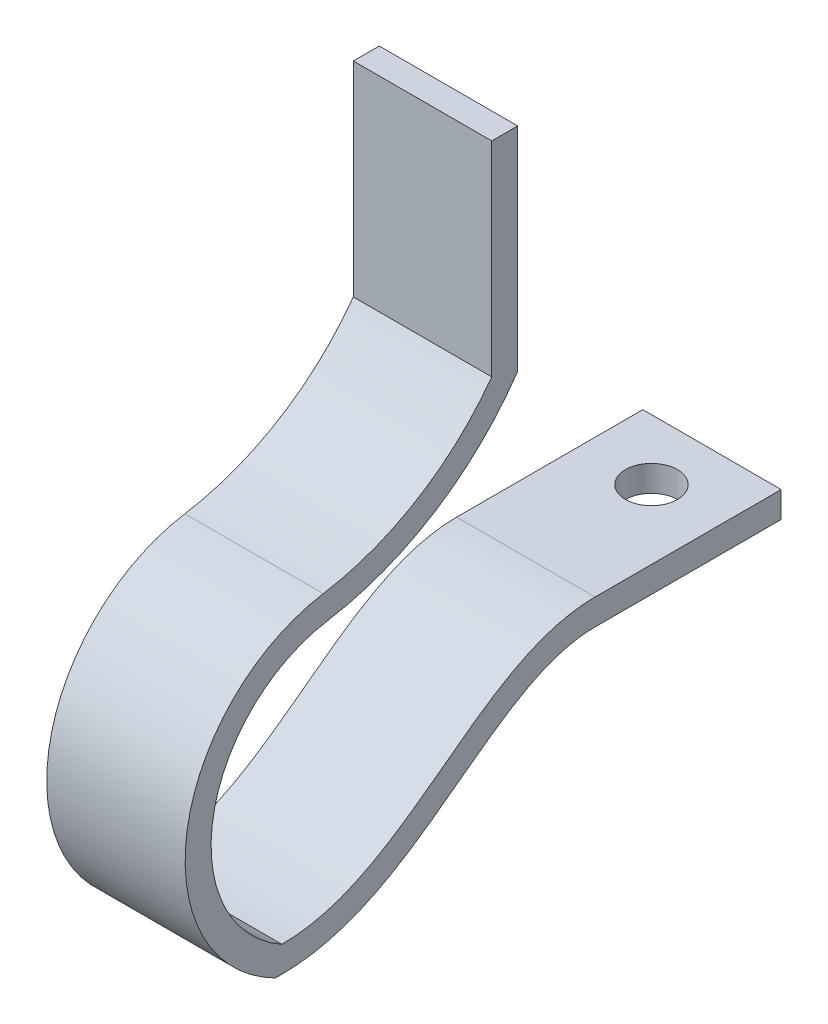
ISO-10303-21;
HEADER;
FILE_DESCRIPTION(('STEP AP214'),'2;1');
FILE_NAME('part.step','',(''),(''),'','','');
FILE_SCHEMA(('AUTOMOTIVE_DESIGN { 1 0 10303 214 1 1 1 1 }'));
ENDSEC;
DATA;
#1=APPLICATION_CONTEXT('core data for automotive mechanical design processes');
#2=APPLICATION_PROTOCOL_DEFINITION('international standard','automotive_design',2000,#1);
#3=PRODUCT_CONTEXT('',#1,'mechanical');
#4=PRODUCT('Part','Part','',(#3));
#5=PRODUCT_RELATED_PRODUCT_CATEGORY('part','',(#4));
#6=PRODUCT_DEFINITION_FORMATION('','',#4);
#7=PRODUCT_DEFINITION_CONTEXT('part definition',#1,'design');
#8=PRODUCT_DEFINITION('design','',#6,#7);
#9=PRODUCT_DEFINITION_SHAPE('','',#8);
#10=(LENGTH_UNIT() NAMED_UNIT(*) SI_UNIT(.MILLI.,.METRE.));
#11=(NAMED_UNIT(*) PLANE_ANGLE_UNIT() SI_UNIT($,.RADIAN.));
#12=(NAMED_UNIT(*) SI_UNIT($,.STERADIAN.) SOLID_ANGLE_UNIT());
#13=UNCERTAINTY_MEASURE_WITH_UNIT(LENGTH_MEASURE(1.E-05),#10,'distance_accuracy_value','');
#14=(GEOMETRIC_REPRESENTATION_CONTEXT(3) GLOBAL_UNCERTAINTY_ASSIGNED_CONTEXT((#13)) GLOBAL_UNIT_ASSIGNED_CONTEXT((#10,
#11,#12)) REPRESENTATION_CONTEXT('',''));
#15=CARTESIAN_POINT('',(0.,0.,0.));
#16=DIRECTION('',(0.,0.,1.));
#17=DIRECTION('',(1.,0.,0.));
#18=AXIS2_PLACEMENT_3D('',#15,#16,#17);
#19=CARTESIAN_POINT('',(-4.064,-12.5578263315465,0.));
#20=DIRECTION('',(0.,1.,0.));
#21=DIRECTION('',(0.,0.,1.));
#22=AXIS2_PLACEMENT_3D('',#19,#20,#21);
#23=PLANE('',#22);
#24=DIRECTION('',(0.,0.,1.));
#25=VECTOR('',#24,1.);
#26=CARTESIAN_POINT('',(0.,-12.5578263315465,0.));
#27=LINE('',#26,#25);
#28=CARTESIAN_POINT('',(0.,-12.5578263315465,1.43547216691102));
#29=VERTEX_POINT('',#28);
#30=CARTESIAN_POINT('',(0.,-12.5578263315465,1.62504224617955));
#31=VERTEX_POINT('',#30);
#32=EDGE_CURVE('E201',#29,#31,#27,.T.);
#33=ORIENTED_EDGE('',*,*,#32,.T.);
#34=DIRECTION('',(1.,0.,0.));
#35=VECTOR('',#34,1.);
#36=CARTESIAN_POINT('',(-4.064,-12.5578263315465,1.62504224617955));
#37=LINE('',#36,#35);
#38=CARTESIAN_POINT('',(-4.064,-12.5578263315465,1.62504224617955));
#39=VERTEX_POINT('',#38);
#40=EDGE_CURVE('E11',#39,#31,#37,.T.);
#41=ORIENTED_EDGE('',*,*,#40,.F.);
#42=DIRECTION('',(0.,0.,1.));
#43=VECTOR('',#42,1.);
#44=CARTESIAN_POINT('',(-4.064,-12.5578263315465,0.));
#45=LINE('',#44,#43);
#46=CARTESIAN_POINT('',(-4.064,-12.5578263315465,1.43547216691102));
#47=VERTEX_POINT('',#46);
#48=EDGE_CURVE('E254',#47,#39,#45,.T.);
#49=ORIENTED_EDGE('',*,*,#48,.F.);
#50=DIRECTION('',(1.,0.,0.));
#51=VECTOR('',#50,1.);
#52=CARTESIAN_POINT('',(-4.064,-12.5578263315465,1.43547216691102));
#53=LINE('',#52,#51);
#54=EDGE_CURVE('E130',#47,#29,#53,.T.);
#55=ORIENTED_EDGE('',*,*,#54,.T.);
#56=EDGE_LOOP('',(#33,#41,#49,#55));
#57=FACE_BOUND('',#56,.T.);
#58=ADVANCED_FACE('F41',(#57),#23,.F.);
#59=CARTESIAN_POINT('',(-4.064,-8.24930670858152,-0.549109233944542));
#60=DIRECTION('',(1.,0.,0.));
#61=DIRECTION('',(0.,0.,-1.));
#62=AXIS2_PLACEMENT_3D('',#59,#60,#61);
#63=CYLINDRICAL_SURFACE('',#62,4.826);
#64=CARTESIAN_POINT('',(0.,-8.24930670858152,-0.549109233944542));
#65=DIRECTION('',(1.,0.,0.));
#66=DIRECTION('',(0.,0.,-1.));
#67=AXIS2_PLACEMENT_3D('',#64,#65,#66);
#68=CIRCLE('',#67,4.826);
#69=CARTESIAN_POINT('',(0.,-3.48505046160105,0.220396070200576));
#70=VERTEX_POINT('',#69);
#71=EDGE_CURVE('E115',#31,#70,#68,.F.);
#72=ORIENTED_EDGE('',*,*,#71,.T.);
#73=DIRECTION('',(1.,0.,0.));
#74=VECTOR('',#73,1.);
#75=CARTESIAN_POINT('',(-4.064,-3.48505046160105,0.220396070200576));
#76=LINE('',#75,#74);
#77=CARTESIAN_POINT('',(-4.064,-3.48505046160105,0.220396070200576));
#78=VERTEX_POINT('',#77);
#79=EDGE_CURVE('E51',#78,#70,#76,.T.);
#80=ORIENTED_EDGE('',*,*,#79,.F.);
#81=CARTESIAN_POINT('',(-4.064,-8.24930670858152,-0.549109233944542));
#82=DIRECTION('',(1.,0.,0.));
#83=DIRECTION('',(0.,0.,-1.));
#84=AXIS2_PLACEMENT_3D('',#81,#82,#83);
#85=CIRCLE('',#84,4.826);
#86=EDGE_CURVE('E62',#39,#78,#85,.F.);
#87=ORIENTED_EDGE('',*,*,#86,.F.);
#88=ORIENTED_EDGE('',*,*,#40,.T.);
#89=EDGE_LOOP('',(#72,#80,#87,#88));
#90=FACE_BOUND('',#89,.T.);
#91=ADVANCED_FACE('F393',(#90),#63,.T.);
#92=CARTESIAN_POINT('',(-4.064,4.03745940205234,1.43540444516655));
#93=DIRECTION('',(1.,0.,0.));
#94=DIRECTION('',(0.,0.,-1.));
#95=AXIS2_PLACEMENT_3D('',#92,#93,#94);
#96=CYLINDRICAL_SURFACE('',#95,7.62);
#97=CARTESIAN_POINT('',(0.,4.03745940205234,1.43540444516655));
#98=DIRECTION('',(1.,0.,0.));
#99=DIRECTION('',(0.,0.,-1.));
#100=AXIS2_PLACEMENT_3D('',#97,#98,#99);
#101=CIRCLE('',#100,7.62);
#102=CARTESIAN_POINT('',(0.,-0.444820699049589,-4.72686503086788));
#103=VERTEX_POINT('',#102);
#104=EDGE_CURVE('E180',#70,#103,#101,.T.);
#105=ORIENTED_EDGE('',*,*,#104,.T.);
#106=DIRECTION('',(1.,0.,0.));
#107=VECTOR('',#106,1.);
#108=CARTESIAN_POINT('',(-4.064,-0.444820699049589,-4.72686503086788));
#109=LINE('',#108,#107);
#110=CARTESIAN_POINT('',(-4.064,-0.444820699049589,-4.72686503086788));
#111=VERTEX_POINT('',#110);
#112=EDGE_CURVE('E178',#111,#103,#109,.T.);
#113=ORIENTED_EDGE('',*,*,#112,.F.);
#114=CARTESIAN_POINT('',(-4.064,4.03745940205234,1.43540444516655));
#115=DIRECTION('',(1.,0.,0.));
#116=DIRECTION('',(0.,0.,-1.));
#117=AXIS2_PLACEMENT_3D('',#114,#115,#116);
#118=CIRCLE('',#117,7.62);
#119=EDGE_CURVE('E167',#78,#111,#118,.T.);
#120=ORIENTED_EDGE('',*,*,#119,.F.);
#121=ORIENTED_EDGE('',*,*,#79,.T.);
#122=EDGE_LOOP('',(#105,#113,#120,#121));
#123=FACE_BOUND('',#122,.T.);
#124=ADVANCED_FACE('F179',(#123),#96,.F.);
#125=CARTESIAN_POINT('',(-4.064,0.,-4.72686503086788));
#126=DIRECTION('',(0.,0.,-1.));
#127=DIRECTION('',(-1.,0.,0.));
#128=AXIS2_PLACEMENT_3D('',#125,#126,#127);
#129=PLANE('',#128);
#130=DIRECTION('',(0.,1.,0.));
#131=VECTOR('',#130,1.);
#132=CARTESIAN_POINT('',(0.,0.,-4.72686503086788));
#133=LINE('',#132,#131);
#134=CARTESIAN_POINT('',(0.,5.55676498261808,-4.72686503086788));
#135=VERTEX_POINT('',#134);
#136=EDGE_CURVE('E249',#103,#135,#133,.T.);
#137=ORIENTED_EDGE('',*,*,#136,.T.);
#138=DIRECTION('',(1.,0.,0.));
#139=VECTOR('',#138,1.);
#140=CARTESIAN_POINT('',(-4.064,5.55676498261808,-4.72686503086788));
#141=LINE('',#140,#139);
#142=CARTESIAN_POINT('',(-4.064,5.55676498261808,-4.72686503086788));
#143=VERTEX_POINT('',#142);
#144=EDGE_CURVE('E185',#143,#135,#141,.T.);
#145=ORIENTED_EDGE('',*,*,#144,.F.);
#146=DIRECTION('',(0.,1.,0.));
#147=VECTOR('',#146,1.);
#148=CARTESIAN_POINT('',(-4.064,0.,-4.72686503086788));
#149=LINE('',#148,#147);
#150=EDGE_CURVE('E172',#111,#143,#149,.T.);
#151=ORIENTED_EDGE('',*,*,#150,.F.);
#152=ORIENTED_EDGE('',*,*,#112,.T.);
#153=EDGE_LOOP('',(#137,#145,#151,#152));
#154=FACE_BOUND('',#153,.T.);
#155=ADVANCED_FACE('F187',(#154),#129,.F.);
#156=CARTESIAN_POINT('',(-4.064,5.55676498261808,0.));
#157=DIRECTION('',(0.,1.,0.));
#158=DIRECTION('',(0.,0.,1.));
#159=AXIS2_PLACEMENT_3D('',#156,#157,#158);
#160=PLANE('',#159);
#161=DIRECTION('',(0.,0.,1.));
#162=VECTOR('',#161,1.);
#163=CARTESIAN_POINT('',(0.,5.55676498261808,0.));
#164=LINE('',#163,#162);
#165=CARTESIAN_POINT('',(0.,5.55676498261808,-5.48886503086788));
#166=VERTEX_POINT('',#165);
#167=EDGE_CURVE('E246',#166,#135,#164,.T.);
#168=ORIENTED_EDGE('',*,*,#167,.F.);
#169=DIRECTION('',(1.,0.,0.));
#170=VECTOR('',#169,1.);
#171=CARTESIAN_POINT('',(-4.064,5.55676498261808,-5.48886503086788));
#172=LINE('',#171,#170);
#173=CARTESIAN_POINT('',(-4.064,5.55676498261808,-5.48886503086788));
#174=VERTEX_POINT('',#173);
#175=EDGE_CURVE('E260',#174,#166,#172,.T.);
#176=ORIENTED_EDGE('',*,*,#175,.F.);
#177=DIRECTION('',(0.,0.,1.));
#178=VECTOR('',#177,1.);
#179=CARTESIAN_POINT('',(-4.064,5.55676498261808,0.));
#180=LINE('',#179,#178);
#181=EDGE_CURVE('E190',#174,#143,#180,.T.);
#182=ORIENTED_EDGE('',*,*,#181,.T.);
#183=ORIENTED_EDGE('',*,*,#144,.T.);
#184=EDGE_LOOP('',(#168,#176,#182,#183));
#185=FACE_BOUND('',#184,.T.);
#186=ADVANCED_FACE('F331',(#185),#160,.T.);
#187=CARTESIAN_POINT('',(-4.064,0.,-5.48886503086788));
#188=DIRECTION('',(0.,0.,-1.));
#189=DIRECTION('',(0.,1.,0.));
#190=AXIS2_PLACEMENT_3D('',#187,#188,#189);
#191=PLANE('',#190);
#192=DIRECTION('',(0.,1.,0.));
#193=VECTOR('',#192,1.);
#194=CARTESIAN_POINT('',(0.,0.,-5.48886503086788));
#195=LINE('',#194,#193);
#196=CARTESIAN_POINT('',(0.,-0.686142636991364,-5.48886503086788));
#197=VERTEX_POINT('',#196);
#198=EDGE_CURVE('E242',#197,#166,#195,.T.);
#199=ORIENTED_EDGE('',*,*,#198,.F.);
#200=DIRECTION('',(1.,0.,0.));
#201=VECTOR('',#200,1.);
#202=CARTESIAN_POINT('',(-4.064,-0.686142636991364,-5.48886503086788));
#203=LINE('',#202,#201);
#204=CARTESIAN_POINT('',(-4.064,-0.686142636991364,-5.48886503086788));
#205=VERTEX_POINT('',#204);
#206=EDGE_CURVE('E263',#205,#197,#203,.T.);
#207=ORIENTED_EDGE('',*,*,#206,.F.);
#208=DIRECTION('',(0.,1.,0.));
#209=VECTOR('',#208,1.);
#210=CARTESIAN_POINT('',(-4.064,0.,-5.48886503086788));
#211=LINE('',#210,#209);
#212=EDGE_CURVE('E195',#205,#174,#211,.T.);
#213=ORIENTED_EDGE('',*,*,#212,.T.);
#214=ORIENTED_EDGE('',*,*,#175,.T.);
#215=EDGE_LOOP('',(#199,#207,#213,#214));
#216=FACE_BOUND('',#215,.T.);
#217=ADVANCED_FACE('F327',(#216),#191,.T.);
#218=CARTESIAN_POINT('',(-4.064,4.03745940205234,1.43540444516655));
#219=DIRECTION('',(1.,0.,0.));
#220=DIRECTION('',(0.,0.,-1.));
#221=AXIS2_PLACEMENT_3D('',#218,#219,#220);
#222=CYLINDRICAL_SURFACE('',#221,8.382);
#223=CARTESIAN_POINT('',(0.,4.03745940205234,1.43540444516655));
#224=DIRECTION('',(1.,0.,0.));
#225=DIRECTION('',(0.,0.,-1.));
#226=AXIS2_PLACEMENT_3D('',#223,#224,#225);
#227=CIRCLE('',#226,8.382);
#228=CARTESIAN_POINT('',(0.,-4.23730144796639,0.0988952327039771));
#229=VERTEX_POINT('',#228);
#230=EDGE_CURVE('E238',#229,#197,#227,.T.);
#231=ORIENTED_EDGE('',*,*,#230,.F.);
#232=DIRECTION('',(1.,0.,0.));
#233=VECTOR('',#232,1.);
#234=CARTESIAN_POINT('',(-4.064,-4.23730144796639,0.0988952327039771));
#235=LINE('',#234,#233);
#236=CARTESIAN_POINT('',(-4.064,-4.23730144796639,0.0988952327039771));
#237=VERTEX_POINT('',#236);
#238=EDGE_CURVE('E266',#237,#229,#235,.T.);
#239=ORIENTED_EDGE('',*,*,#238,.F.);
#240=CARTESIAN_POINT('',(-4.064,4.03745940205234,1.43540444516655));
#241=DIRECTION('',(1.,0.,0.));
#242=DIRECTION('',(0.,0.,-1.));
#243=AXIS2_PLACEMENT_3D('',#240,#241,#242);
#244=CIRCLE('',#243,8.382);
#245=EDGE_CURVE('E332',#237,#205,#244,.T.);
#246=ORIENTED_EDGE('',*,*,#245,.T.);
#247=ORIENTED_EDGE('',*,*,#206,.T.);
#248=EDGE_LOOP('',(#231,#239,#246,#247));
#249=FACE_BOUND('',#248,.T.);
#250=ADVANCED_FACE('F323',(#249),#222,.T.);
#251=CARTESIAN_POINT('',(-4.064,-8.24930670858152,-0.549109233944542));
#252=DIRECTION('',(1.,0.,0.));
#253=DIRECTION('',(0.,0.,-1.));
#254=AXIS2_PLACEMENT_3D('',#251,#252,#253);
#255=CYLINDRICAL_SURFACE('',#254,4.064);
#256=CARTESIAN_POINT('',(0.,-8.24930670858152,-0.549109233944542));
#257=DIRECTION('',(1.,0.,0.));
#258=DIRECTION('',(0.,0.,-1.));
#259=AXIS2_PLACEMENT_3D('',#256,#257,#258);
#260=CIRCLE('',#259,4.064);
#261=CARTESIAN_POINT('',(0.,-11.7958263345558,1.43540444516655));
#262=VERTEX_POINT('',#261);
#263=EDGE_CURVE('E232',#262,#229,#260,.F.);
#264=ORIENTED_EDGE('',*,*,#263,.F.);
#265=DIRECTION('',(1.,0.,0.));
#266=VECTOR('',#265,1.);
#267=CARTESIAN_POINT('',(-4.064,-11.7958263345558,1.43540444516655));
#268=LINE('',#267,#266);
#269=CARTESIAN_POINT('',(-4.064,-11.7958263345558,1.43540444516655));
#270=VERTEX_POINT('',#269);
#271=EDGE_CURVE('E269',#270,#262,#268,.T.);
#272=ORIENTED_EDGE('',*,*,#271,.F.);
#273=CARTESIAN_POINT('',(-4.064,-8.24930670858152,-0.549109233944542));
#274=DIRECTION('',(1.,0.,0.));
#275=DIRECTION('',(0.,0.,-1.));
#276=AXIS2_PLACEMENT_3D('',#273,#274,#275);
#277=CIRCLE('',#276,4.064);
#278=EDGE_CURVE('E319',#270,#237,#277,.F.);
#279=ORIENTED_EDGE('',*,*,#278,.T.);
#280=ORIENTED_EDGE('',*,*,#238,.T.);
#281=EDGE_LOOP('',(#264,#272,#279,#280));
#282=FACE_BOUND('',#281,.T.);
#283=ADVANCED_FACE('F315',(#282),#255,.F.);
#284=CARTESIAN_POINT('',(-4.064,-11.7958263345558,1.43540444516655));
#285=CARTESIAN_POINT('',(-4.064,-11.7961009711247,-1.65478565920988));
#286=CARTESIAN_POINT('',(-4.064,-8.22231699908811,-4.00686682705955));
#287=CARTESIAN_POINT('',(-4.064,-7.56142439433131,-7.22655746099775));
#288=CARTESIAN_POINT('',(-4.064,-7.56142451904645,-7.76106757625816));
#289=B_SPLINE_CURVE_WITH_KNOTS('',3,(#284,#285,#286,#287,#288),.UNSPECIFIED.,.F.,.F.,(4,1,4),
(0.,0.739499727671517,0.876252105123587),.UNSPECIFIED.);
#290=DIRECTION('',(1.,0.,0.));
#291=VECTOR('',#290,1.);
#292=SURFACE_OF_LINEAR_EXTRUSION('',#289,#291);
#293=CARTESIAN_POINT('',(0.,-11.7958263345558,1.43540444516655));
#294=CARTESIAN_POINT('',(0.,-11.7961009711247,-1.65478565920988));
#295=CARTESIAN_POINT('',(0.,-8.22231699908811,-4.00686682705955));
#296=CARTESIAN_POINT('',(0.,-7.56142439433131,-7.22655746099775));
#297=CARTESIAN_POINT('',(0.,-7.56142451904645,-7.76106757625816));
#298=B_SPLINE_CURVE_WITH_KNOTS('',3,(#293,#294,#295,#296,#297),.UNSPECIFIED.,.F.,.F.,(4,1,4),
(0.,0.739499727671517,0.876252105123587),.UNSPECIFIED.);
#299=CARTESIAN_POINT('',(0.,-7.56142451904634,-7.76106757625816));
#300=VERTEX_POINT('',#299);
#301=EDGE_CURVE('E226',#262,#300,#298,.T.);
#302=ORIENTED_EDGE('',*,*,#301,.T.);
#303=DIRECTION('',(1.,0.,0.));
#304=VECTOR('',#303,1.);
#305=CARTESIAN_POINT('',(-4.064,-7.56142451904634,-7.76106757625816));
#306=LINE('',#305,#304);
#307=CARTESIAN_POINT('',(-4.064,-7.56142451904634,-7.76106757625816));
#308=VERTEX_POINT('',#307);
#309=EDGE_CURVE('E272',#308,#300,#306,.T.);
#310=ORIENTED_EDGE('',*,*,#309,.F.);
#311=EDGE_CURVE('E336',#270,#308,#289,.T.);
#312=ORIENTED_EDGE('',*,*,#311,.F.);
#313=ORIENTED_EDGE('',*,*,#271,.T.);
#314=EDGE_LOOP('',(#302,#310,#312,#313));
#315=FACE_BOUND('',#314,.T.);
#316=ADVANCED_FACE('F312',(#315),#292,.F.);
#317=CARTESIAN_POINT('',(-4.064,-7.56142451904618,1.53951707831676E-13));
#318=DIRECTION('',(0.,1.,0.));
#319=DIRECTION('',(0.,0.,1.));
#320=AXIS2_PLACEMENT_3D('',#317,#318,#319);
#321=PLANE('',#320);
#322=CARTESIAN_POINT('',(-2.032,-7.56142451904641,-11.4501278396525));
#323=DIRECTION('',(0.,1.,0.));
#324=DIRECTION('',(0.,0.,1.));
#325=AXIS2_PLACEMENT_3D('',#322,#323,#324);
#326=CIRCLE('',#325,0.762);
#327=CARTESIAN_POINT('',(-2.032,-7.5614245190464,-10.6881278396525));
#328=VERTEX_POINT('',#327);
#329=EDGE_CURVE('E379',#328,#328,#326,.T.);
#330=ORIENTED_EDGE('',*,*,#329,.F.);
#331=EDGE_LOOP('',(#330));
#332=FACE_BOUND('',#331,.T.);
#333=DIRECTION('',(0.,0.,1.));
#334=VECTOR('',#333,1.);
#335=CARTESIAN_POINT('',(0.,-7.56142451904618,1.53951707831676E-13));
#336=LINE('',#335,#334);
#337=CARTESIAN_POINT('',(0.,-7.56142451904645,-13.2281278396525));
#338=VERTEX_POINT('',#337);
#339=EDGE_CURVE('E222',#338,#300,#336,.T.);
#340=ORIENTED_EDGE('',*,*,#339,.F.);
#341=DIRECTION('',(1.,0.,0.));
#342=VECTOR('',#341,1.);
#343=CARTESIAN_POINT('',(-4.064,-7.56142451904645,-13.2281278396525));
#344=LINE('',#343,#342);
#345=CARTESIAN_POINT('',(-4.064,-7.56142451904645,-13.2281278396525));
#346=VERTEX_POINT('',#345);
#347=EDGE_CURVE('E275',#346,#338,#344,.T.);
#348=ORIENTED_EDGE('',*,*,#347,.F.);
#349=DIRECTION('',(0.,0.,1.));
#350=VECTOR('',#349,1.);
#351=CARTESIAN_POINT('',(-4.064,-7.56142451904618,1.53951707831676E-13));
#352=LINE('',#351,#350);
#353=EDGE_CURVE('E309',#346,#308,#352,.T.);
#354=ORIENTED_EDGE('',*,*,#353,.T.);
#355=ORIENTED_EDGE('',*,*,#309,.T.);
#356=EDGE_LOOP('',(#340,#348,#354,#355));
#357=FACE_BOUND('',#356,.T.);
#358=ADVANCED_FACE('F307',(#332,#357),#321,.T.);
#359=CARTESIAN_POINT('',(-4.064,0.,-13.2281278396525));
#360=DIRECTION('',(0.,0.,-1.));
#361=DIRECTION('',(-1.,0.,0.));
#362=AXIS2_PLACEMENT_3D('',#359,#360,#361);
#363=PLANE('',#362);
#364=DIRECTION('',(0.,1.,0.));
#365=VECTOR('',#364,1.);
#366=CARTESIAN_POINT('',(0.,0.,-13.2281278396525));
#367=LINE('',#366,#365);
#368=CARTESIAN_POINT('',(0.,-8.32342451904643,-13.2281278396525));
#369=VERTEX_POINT('',#368);
#370=EDGE_CURVE('E218',#369,#338,#367,.T.);
#371=ORIENTED_EDGE('',*,*,#370,.F.);
#372=DIRECTION('',(1.,0.,0.));
#373=VECTOR('',#372,1.);
#374=CARTESIAN_POINT('',(-4.064,-8.32342451904643,-13.2281278396525));
#375=LINE('',#374,#373);
#376=CARTESIAN_POINT('',(-4.064,-8.32342451904643,-13.2281278396525));
#377=VERTEX_POINT('',#376);
#378=EDGE_CURVE('E278',#377,#369,#375,.T.);
#379=ORIENTED_EDGE('',*,*,#378,.F.);
#380=DIRECTION('',(0.,1.,0.));
#381=VECTOR('',#380,1.);
#382=CARTESIAN_POINT('',(-4.064,0.,-13.2281278396525));
#383=LINE('',#382,#381);
#384=EDGE_CURVE('E303',#377,#346,#383,.T.);
#385=ORIENTED_EDGE('',*,*,#384,.T.);
#386=ORIENTED_EDGE('',*,*,#347,.T.);
#387=EDGE_LOOP('',(#371,#379,#385,#386));
#388=FACE_BOUND('',#387,.T.);
#389=ADVANCED_FACE('F300',(#388),#363,.T.);
#390=CARTESIAN_POINT('',(-4.064,-8.32342451904643,0.));
#391=DIRECTION('',(0.,-1.,0.));
#392=DIRECTION('',(0.,0.,-1.));
#393=AXIS2_PLACEMENT_3D('',#390,#391,#392);
#394=PLANE('',#393);
#395=CARTESIAN_POINT('',(-2.032,-8.32342451904643,-11.4501278396525));
#396=DIRECTION('',(0.,-1.,0.));
#397=DIRECTION('',(0.,0.,-1.));
#398=AXIS2_PLACEMENT_3D('',#395,#396,#397);
#399=CIRCLE('',#398,0.762);
#400=CARTESIAN_POINT('',(-2.032,-8.32342451904643,-12.2121278396525));
#401=VERTEX_POINT('',#400);
#402=EDGE_CURVE('E44',#401,#401,#399,.T.);
#403=ORIENTED_EDGE('',*,*,#402,.F.);
#404=EDGE_LOOP('',(#403));
#405=FACE_BOUND('',#404,.T.);
#406=DIRECTION('',(0.,0.,-1.));
#407=VECTOR('',#406,1.);
#408=CARTESIAN_POINT('',(0.,-8.32342451904643,0.));
#409=LINE('',#408,#407);
#410=CARTESIAN_POINT('',(0.,-8.32342451904643,-7.76106739846371));
#411=VERTEX_POINT('',#410);
#412=EDGE_CURVE('E211',#411,#369,#409,.T.);
#413=ORIENTED_EDGE('',*,*,#412,.F.);
#414=DIRECTION('',(1.,0.,0.));
#415=VECTOR('',#414,1.);
#416=CARTESIAN_POINT('',(-4.064,-8.32342451904643,-7.76106739846371));
#417=LINE('',#416,#415);
#418=CARTESIAN_POINT('',(-4.064,-8.32342451904643,-7.76106739846371));
#419=VERTEX_POINT('',#418);
#420=EDGE_CURVE('E281',#419,#411,#417,.T.);
#421=ORIENTED_EDGE('',*,*,#420,.F.);
#422=DIRECTION('',(0.,0.,-1.));
#423=VECTOR('',#422,1.);
#424=CARTESIAN_POINT('',(-4.064,-8.32342451904643,0.));
#425=LINE('',#424,#423);
#426=EDGE_CURVE('E368',#419,#377,#425,.T.);
#427=ORIENTED_EDGE('',*,*,#426,.T.);
#428=ORIENTED_EDGE('',*,*,#378,.T.);
#429=EDGE_LOOP('',(#413,#421,#427,#428));
#430=FACE_BOUND('',#429,.T.);
#431=ADVANCED_FACE('F295',(#405,#430),#394,.T.);
#432=CARTESIAN_POINT('',(-4.064,-12.5578263315465,1.43547216691102));
#433=CARTESIAN_POINT('',(-4.064,-12.5578493985289,1.17592420818341));
#434=CARTESIAN_POINT('',(-4.064,-12.5193924049224,0.648911082786081));
#435=CARTESIAN_POINT('',(-4.064,-12.3089217180155,-0.32614536992932));
#436=CARTESIAN_POINT('',(-4.064,-11.8416650027739,-1.44023951255252));
#437=CARTESIAN_POINT('',(-4.064,-11.096563597146,-2.62686244416652));
#438=CARTESIAN_POINT('',(-4.064,-10.0110657930647,-4.08033485790667));
#439=CARTESIAN_POINT('',(-4.064,-8.74693421282194,-5.76922103333233));
#440=CARTESIAN_POINT('',(-4.064,-8.32342435688735,-7.06607823706334));
#441=CARTESIAN_POINT('',(-4.064,-8.32342451904643,-7.76106739846371));
#442=B_SPLINE_CURVE_WITH_KNOTS('',3,(#432,#433,#434,#435,#436,#437,#438,#439,#440,#441),
.UNSPECIFIED.,.F.,.F.,(4,1,1,1,1,1,1,4),(0.,0.0547657565702242,0.109531513140448,
0.219063026280897,0.328594539421345,0.438126052561794,0.657189078842691,0.876252105123587),.UNSPECIFIED.);
#443=DIRECTION('',(1.,0.,0.));
#444=VECTOR('',#443,1.);
#445=SURFACE_OF_LINEAR_EXTRUSION('',#442,#444);
#446=CARTESIAN_POINT('',(0.,-12.5578263315465,1.43547216691102));
#447=CARTESIAN_POINT('',(0.,-12.5578493985289,1.17592420818341));
#448=CARTESIAN_POINT('',(0.,-12.5193924049224,0.648911082786081));
#449=CARTESIAN_POINT('',(0.,-12.3089217180155,-0.32614536992932));
#450=CARTESIAN_POINT('',(0.,-11.8416650027739,-1.44023951255252));
#451=CARTESIAN_POINT('',(0.,-11.096563597146,-2.62686244416652));
#452=CARTESIAN_POINT('',(0.,-10.0110657930647,-4.08033485790667));
#453=CARTESIAN_POINT('',(0.,-8.74693421282194,-5.76922103333233));
#454=CARTESIAN_POINT('',(0.,-8.32342435688735,-7.06607823706334));
#455=CARTESIAN_POINT('',(0.,-8.32342451904643,-7.76106739846371));
#456=B_SPLINE_CURVE_WITH_KNOTS('',3,(#446,#447,#448,#449,#450,#451,#452,#453,#454,#455),
.UNSPECIFIED.,.F.,.F.,(4,1,1,1,1,1,1,4),(0.,0.0547657565702242,0.109531513140448,
0.219063026280897,0.328594539421345,0.438126052561794,0.657189078842691,0.876252105123587),.UNSPECIFIED.);
#457=EDGE_CURVE('E205',#29,#411,#456,.T.);
#458=ORIENTED_EDGE('',*,*,#457,.F.);
#459=ORIENTED_EDGE('',*,*,#54,.F.);
#460=EDGE_CURVE('E291',#47,#419,#442,.T.);
#461=ORIENTED_EDGE('',*,*,#460,.T.);
#462=ORIENTED_EDGE('',*,*,#420,.T.);
#463=EDGE_LOOP('',(#458,#459,#461,#462));
#464=FACE_BOUND('',#463,.T.);
#465=ADVANCED_FACE('F289',(#464),#445,.T.);
#466=CARTESIAN_POINT('',(-4.064,0.,0.));
#467=DIRECTION('',(1.,0.,0.));
#468=DIRECTION('',(0.,0.,-1.));
#469=AXIS2_PLACEMENT_3D('',#466,#467,#468);
#470=PLANE('',#469);
#471=ORIENTED_EDGE('',*,*,#48,.T.);
#472=ORIENTED_EDGE('',*,*,#86,.T.);
#473=ORIENTED_EDGE('',*,*,#119,.T.);
#474=ORIENTED_EDGE('',*,*,#150,.T.);
#475=ORIENTED_EDGE('',*,*,#181,.F.);
#476=ORIENTED_EDGE('',*,*,#212,.F.);
#477=ORIENTED_EDGE('',*,*,#245,.F.);
#478=ORIENTED_EDGE('',*,*,#278,.F.);
#479=ORIENTED_EDGE('',*,*,#311,.T.);
#480=ORIENTED_EDGE('',*,*,#353,.F.);
#481=ORIENTED_EDGE('',*,*,#384,.F.);
#482=ORIENTED_EDGE('',*,*,#426,.F.);
#483=ORIENTED_EDGE('',*,*,#460,.F.);
#484=EDGE_LOOP('',(#471,#472,#473,#474,#475,#476,#477,#478,#479,#480,#481,#482,#483));
#485=FACE_BOUND('',#484,.T.);
#486=ADVANCED_FACE('F169',(#485),#470,.F.);
#487=CARTESIAN_POINT('',(0.,0.,0.));
#488=DIRECTION('',(1.,0.,0.));
#489=DIRECTION('',(0.,0.,-1.));
#490=AXIS2_PLACEMENT_3D('',#487,#488,#489);
#491=PLANE('',#490);
#492=ORIENTED_EDGE('',*,*,#32,.F.);
#493=ORIENTED_EDGE('',*,*,#457,.T.);
#494=ORIENTED_EDGE('',*,*,#412,.T.);
#495=ORIENTED_EDGE('',*,*,#370,.T.);
#496=ORIENTED_EDGE('',*,*,#339,.T.);
#497=ORIENTED_EDGE('',*,*,#301,.F.);
#498=ORIENTED_EDGE('',*,*,#263,.T.);
#499=ORIENTED_EDGE('',*,*,#230,.T.);
#500=ORIENTED_EDGE('',*,*,#198,.T.);
#501=ORIENTED_EDGE('',*,*,#167,.T.);
#502=ORIENTED_EDGE('',*,*,#136,.F.);
#503=ORIENTED_EDGE('',*,*,#104,.F.);
#504=ORIENTED_EDGE('',*,*,#71,.F.);
#505=EDGE_LOOP('',(#492,#493,#494,#495,#496,#497,#498,#499,#500,#501,#502,#503,#504));
#506=FACE_BOUND('',#505,.T.);
#507=ADVANCED_FACE('F288',(#506),#491,.T.);
#508=CARTESIAN_POINT('',(-2.032,-12.5578493985292,-11.4501278396524));
#509=DIRECTION('',(0.,1.,0.));
#510=DIRECTION('',(0.,0.,1.));
#511=AXIS2_PLACEMENT_3D('',#508,#509,#510);
#512=CYLINDRICAL_SURFACE('',#511,0.762);
#513=ORIENTED_EDGE('',*,*,#402,.T.);
#514=EDGE_LOOP('',(#513));
#515=FACE_BOUND('',#514,.T.);
#516=ORIENTED_EDGE('',*,*,#329,.T.);
#517=EDGE_LOOP('',(#516));
#518=FACE_BOUND('',#517,.T.);
#519=ADVANCED_FACE('F383',(#515,#518),#512,.F.);
#520=CLOSED_SHELL('',(#58,#91,#124,#155,#186,#217,#250,#283,#316,#358,#389,#431,#465,#486,#507,#519));
#521=MANIFOLD_SOLID_BREP('B2',#520);
#522=ADVANCED_BREP_SHAPE_REPRESENTATION('',(#18,#521),#14);
#523=SHAPE_DEFINITION_REPRESENTATION(#9,#522);
ENDSEC;
END-ISO-10303-21;
